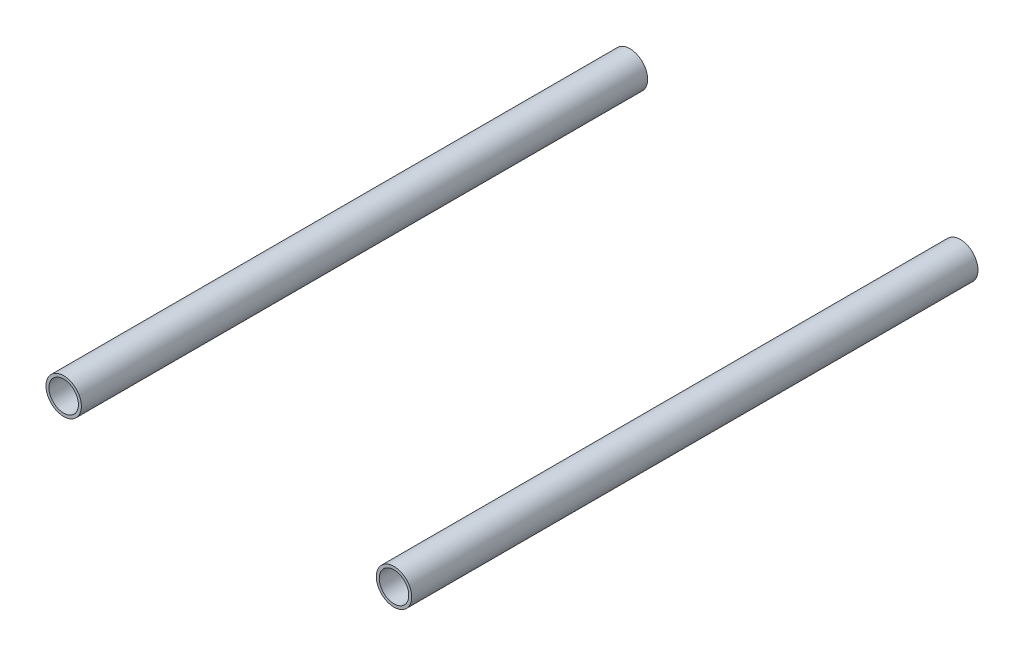
ISO-10303-21;
HEADER;
FILE_DESCRIPTION(('STEP AP214'),'2;1');
FILE_NAME('part.step','',(''),(''),'','','');
FILE_SCHEMA(('AUTOMOTIVE_DESIGN { 1 0 10303 214 1 1 1 1 }'));
ENDSEC;
DATA;
#1=APPLICATION_CONTEXT('core data for automotive mechanical design processes');
#2=APPLICATION_PROTOCOL_DEFINITION('international standard','automotive_design',2000,#1);
#3=PRODUCT_CONTEXT('',#1,'mechanical');
#4=PRODUCT('Part','Part','',(#3));
#5=PRODUCT_RELATED_PRODUCT_CATEGORY('part','',(#4));
#6=PRODUCT_DEFINITION_FORMATION('','',#4);
#7=PRODUCT_DEFINITION_CONTEXT('part definition',#1,'design');
#8=PRODUCT_DEFINITION('design','',#6,#7);
#9=PRODUCT_DEFINITION_SHAPE('','',#8);
#10=(LENGTH_UNIT() NAMED_UNIT(*) SI_UNIT(.MILLI.,.METRE.));
#11=(NAMED_UNIT(*) PLANE_ANGLE_UNIT() SI_UNIT($,.RADIAN.));
#12=(NAMED_UNIT(*) SI_UNIT($,.STERADIAN.) SOLID_ANGLE_UNIT());
#13=UNCERTAINTY_MEASURE_WITH_UNIT(LENGTH_MEASURE(1.E-05),#10,'distance_accuracy_value','');
#14=(GEOMETRIC_REPRESENTATION_CONTEXT(3) GLOBAL_UNCERTAINTY_ASSIGNED_CONTEXT((#13)) GLOBAL_UNIT_ASSIGNED_CONTEXT((#10,
#11,#12)) REPRESENTATION_CONTEXT('',''));
#15=CARTESIAN_POINT('',(0.,0.,0.));
#16=DIRECTION('',(0.,0.,1.));
#17=DIRECTION('',(1.,0.,0.));
#18=AXIS2_PLACEMENT_3D('',#15,#16,#17);
#19=CARTESIAN_POINT('',(177.8,0.,152.4));
#20=DIRECTION('',(0.,0.,-1.));
#21=DIRECTION('',(-1.,0.,0.));
#22=AXIS2_PLACEMENT_3D('',#19,#20,#21);
#23=CYLINDRICAL_SURFACE('',#22,7.93750000000001);
#24=CARTESIAN_POINT('',(177.8,0.,152.4));
#25=DIRECTION('',(0.,0.,1.));
#26=DIRECTION('',(1.,0.,0.));
#27=AXIS2_PLACEMENT_3D('',#24,#25,#26);
#28=CIRCLE('',#27,7.93750000000001);
#29=CARTESIAN_POINT('',(185.7375,0.,152.4));
#30=VERTEX_POINT('',#29);
#31=EDGE_CURVE('E51',#30,#30,#28,.T.);
#32=ORIENTED_EDGE('',*,*,#31,.T.);
#33=EDGE_LOOP('',(#32));
#34=FACE_BOUND('',#33,.T.);
#35=CARTESIAN_POINT('',(177.8,0.,-152.4));
#36=DIRECTION('',(0.,0.,1.));
#37=DIRECTION('',(1.,0.,0.));
#38=AXIS2_PLACEMENT_3D('',#35,#36,#37);
#39=CIRCLE('',#38,7.93750000000001);
#40=CARTESIAN_POINT('',(185.7375,0.,-152.4));
#41=VERTEX_POINT('',#40);
#42=EDGE_CURVE('E57',#41,#41,#39,.T.);
#43=ORIENTED_EDGE('',*,*,#42,.F.);
#44=EDGE_LOOP('',(#43));
#45=FACE_BOUND('',#44,.T.);
#46=ADVANCED_FACE('F44',(#34,#45),#23,.F.);
#47=CARTESIAN_POINT('',(177.8,0.,152.4));
#48=DIRECTION('',(0.,0.,-1.));
#49=DIRECTION('',(-1.,0.,0.));
#50=AXIS2_PLACEMENT_3D('',#47,#48,#49);
#51=CYLINDRICAL_SURFACE('',#50,9.525);
#52=CARTESIAN_POINT('',(177.8,0.,152.4));
#53=DIRECTION('',(0.,0.,1.));
#54=DIRECTION('',(1.,0.,0.));
#55=AXIS2_PLACEMENT_3D('',#52,#53,#54);
#56=CIRCLE('',#55,9.525);
#57=CARTESIAN_POINT('',(187.325,0.,152.4));
#58=VERTEX_POINT('',#57);
#59=EDGE_CURVE('E11',#58,#58,#56,.T.);
#60=ORIENTED_EDGE('',*,*,#59,.F.);
#61=EDGE_LOOP('',(#60));
#62=FACE_BOUND('',#61,.T.);
#63=CARTESIAN_POINT('',(177.8,0.,-152.4));
#64=DIRECTION('',(0.,0.,1.));
#65=DIRECTION('',(1.,0.,0.));
#66=AXIS2_PLACEMENT_3D('',#63,#64,#65);
#67=CIRCLE('',#66,9.525);
#68=CARTESIAN_POINT('',(187.325,0.,-152.4));
#69=VERTEX_POINT('',#68);
#70=EDGE_CURVE('E47',#69,#69,#67,.T.);
#71=ORIENTED_EDGE('',*,*,#70,.T.);
#72=EDGE_LOOP('',(#71));
#73=FACE_BOUND('',#72,.T.);
#74=ADVANCED_FACE('F64',(#62,#73),#51,.T.);
#75=CARTESIAN_POINT('',(0.,0.,152.4));
#76=DIRECTION('',(0.,0.,1.));
#77=DIRECTION('',(1.,0.,0.));
#78=AXIS2_PLACEMENT_3D('',#75,#76,#77);
#79=PLANE('',#78);
#80=ORIENTED_EDGE('',*,*,#31,.F.);
#81=EDGE_LOOP('',(#80));
#82=FACE_BOUND('',#81,.T.);
#83=ORIENTED_EDGE('',*,*,#59,.T.);
#84=EDGE_LOOP('',(#83));
#85=FACE_BOUND('',#84,.T.);
#86=ADVANCED_FACE('F68',(#82,#85),#79,.T.);
#87=CARTESIAN_POINT('',(0.,0.,-152.4));
#88=DIRECTION('',(0.,0.,1.));
#89=DIRECTION('',(1.,0.,0.));
#90=AXIS2_PLACEMENT_3D('',#87,#88,#89);
#91=PLANE('',#90);
#92=ORIENTED_EDGE('',*,*,#42,.T.);
#93=EDGE_LOOP('',(#92));
#94=FACE_BOUND('',#93,.T.);
#95=ORIENTED_EDGE('',*,*,#70,.F.);
#96=EDGE_LOOP('',(#95));
#97=FACE_BOUND('',#96,.T.);
#98=ADVANCED_FACE('F66',(#94,#97),#91,.F.);
#99=CLOSED_SHELL('',(#46,#74,#86,#98));
#100=MANIFOLD_SOLID_BREP('B2',#99);
#101=CARTESIAN_POINT('',(0.,0.,152.4));
#102=DIRECTION('',(0.,0.,-1.));
#103=DIRECTION('',(-1.,0.,0.));
#104=AXIS2_PLACEMENT_3D('',#101,#102,#103);
#105=CYLINDRICAL_SURFACE('',#104,7.9375);
#106=CARTESIAN_POINT('',(0.,0.,152.4));
#107=DIRECTION('',(0.,0.,1.));
#108=DIRECTION('',(1.,0.,0.));
#109=AXIS2_PLACEMENT_3D('',#106,#107,#108);
#110=CIRCLE('',#109,7.9375);
#111=CARTESIAN_POINT('',(7.9375,0.,152.4));
#112=VERTEX_POINT('',#111);
#113=EDGE_CURVE('E112',#112,#112,#110,.T.);
#114=ORIENTED_EDGE('',*,*,#113,.T.);
#115=EDGE_LOOP('',(#114));
#116=FACE_BOUND('',#115,.T.);
#117=CARTESIAN_POINT('',(0.,0.,-152.4));
#118=DIRECTION('',(0.,0.,1.));
#119=DIRECTION('',(1.,0.,0.));
#120=AXIS2_PLACEMENT_3D('',#117,#118,#119);
#121=CIRCLE('',#120,7.9375);
#122=CARTESIAN_POINT('',(7.9375,0.,-152.4));
#123=VERTEX_POINT('',#122);
#124=EDGE_CURVE('E118',#123,#123,#121,.T.);
#125=ORIENTED_EDGE('',*,*,#124,.F.);
#126=EDGE_LOOP('',(#125));
#127=FACE_BOUND('',#126,.T.);
#128=ADVANCED_FACE('F105',(#116,#127),#105,.F.);
#129=CARTESIAN_POINT('',(0.,0.,152.4));
#130=DIRECTION('',(0.,0.,-1.));
#131=DIRECTION('',(-1.,0.,0.));
#132=AXIS2_PLACEMENT_3D('',#129,#130,#131);
#133=CYLINDRICAL_SURFACE('',#132,9.525);
#134=CARTESIAN_POINT('',(0.,0.,152.4));
#135=DIRECTION('',(0.,0.,1.));
#136=DIRECTION('',(1.,0.,0.));
#137=AXIS2_PLACEMENT_3D('',#134,#135,#136);
#138=CIRCLE('',#137,9.525);
#139=CARTESIAN_POINT('',(9.525,0.,152.4));
#140=VERTEX_POINT('',#139);
#141=EDGE_CURVE('E43',#140,#140,#138,.T.);
#142=ORIENTED_EDGE('',*,*,#141,.F.);
#143=EDGE_LOOP('',(#142));
#144=FACE_BOUND('',#143,.T.);
#145=CARTESIAN_POINT('',(0.,0.,-152.4));
#146=DIRECTION('',(0.,0.,1.));
#147=DIRECTION('',(1.,0.,0.));
#148=AXIS2_PLACEMENT_3D('',#145,#146,#147);
#149=CIRCLE('',#148,9.525);
#150=CARTESIAN_POINT('',(9.525,0.,-152.4));
#151=VERTEX_POINT('',#150);
#152=EDGE_CURVE('E108',#151,#151,#149,.T.);
#153=ORIENTED_EDGE('',*,*,#152,.T.);
#154=EDGE_LOOP('',(#153));
#155=FACE_BOUND('',#154,.T.);
#156=ADVANCED_FACE('F125',(#144,#155),#133,.T.);
#157=CARTESIAN_POINT('',(0.,0.,152.4));
#158=DIRECTION('',(0.,0.,1.));
#159=DIRECTION('',(1.,0.,0.));
#160=AXIS2_PLACEMENT_3D('',#157,#158,#159);
#161=PLANE('',#160);
#162=ORIENTED_EDGE('',*,*,#113,.F.);
#163=EDGE_LOOP('',(#162));
#164=FACE_BOUND('',#163,.T.);
#165=ORIENTED_EDGE('',*,*,#141,.T.);
#166=EDGE_LOOP('',(#165));
#167=FACE_BOUND('',#166,.T.);
#168=ADVANCED_FACE('F129',(#164,#167),#161,.T.);
#169=CARTESIAN_POINT('',(0.,0.,-152.4));
#170=DIRECTION('',(0.,0.,1.));
#171=DIRECTION('',(1.,0.,0.));
#172=AXIS2_PLACEMENT_3D('',#169,#170,#171);
#173=PLANE('',#172);
#174=ORIENTED_EDGE('',*,*,#124,.T.);
#175=EDGE_LOOP('',(#174));
#176=FACE_BOUND('',#175,.T.);
#177=ORIENTED_EDGE('',*,*,#152,.F.);
#178=EDGE_LOOP('',(#177));
#179=FACE_BOUND('',#178,.T.);
#180=ADVANCED_FACE('F127',(#176,#179),#173,.F.);
#181=CLOSED_SHELL('',(#128,#156,#168,#180));
#182=MANIFOLD_SOLID_BREP('B6',#181);
#183=ADVANCED_BREP_SHAPE_REPRESENTATION('',(#18,#100,#182),#14);
#184=SHAPE_DEFINITION_REPRESENTATION(#9,#183);
ENDSEC;
END-ISO-10303-21;
